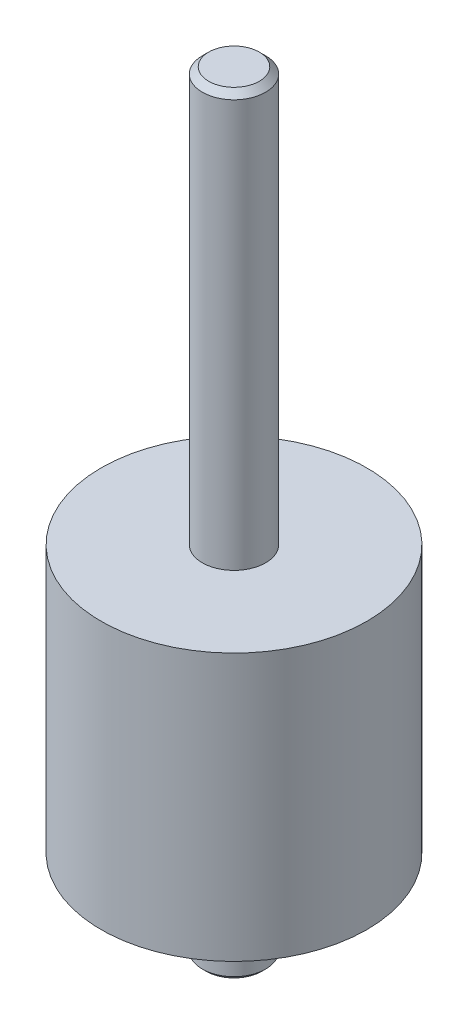
ISO-10303-21;
HEADER;
FILE_DESCRIPTION(('STEP AP214'),'2;1');
FILE_NAME('part.step','',(''),(''),'','','');
FILE_SCHEMA(('AUTOMOTIVE_DESIGN { 1 0 10303 214 1 1 1 1 }'));
ENDSEC;
DATA;
#1=APPLICATION_CONTEXT('core data for automotive mechanical design processes');
#2=APPLICATION_PROTOCOL_DEFINITION('international standard','automotive_design',2000,#1);
#3=PRODUCT_CONTEXT('',#1,'mechanical');
#4=PRODUCT('Part','Part','',(#3));
#5=PRODUCT_RELATED_PRODUCT_CATEGORY('part','',(#4));
#6=PRODUCT_DEFINITION_FORMATION('','',#4);
#7=PRODUCT_DEFINITION_CONTEXT('part definition',#1,'design');
#8=PRODUCT_DEFINITION('design','',#6,#7);
#9=PRODUCT_DEFINITION_SHAPE('','',#8);
#10=(LENGTH_UNIT() NAMED_UNIT(*) SI_UNIT(.MILLI.,.METRE.));
#11=(NAMED_UNIT(*) PLANE_ANGLE_UNIT() SI_UNIT($,.RADIAN.));
#12=(NAMED_UNIT(*) SI_UNIT($,.STERADIAN.) SOLID_ANGLE_UNIT());
#13=UNCERTAINTY_MEASURE_WITH_UNIT(LENGTH_MEASURE(1.E-05),#10,'distance_accuracy_value','');
#14=(GEOMETRIC_REPRESENTATION_CONTEXT(3) GLOBAL_UNCERTAINTY_ASSIGNED_CONTEXT((#13)) GLOBAL_UNIT_ASSIGNED_CONTEXT((#10,
#11,#12)) REPRESENTATION_CONTEXT('',''));
#15=CARTESIAN_POINT('',(0.,0.,0.));
#16=DIRECTION('',(0.,0.,1.));
#17=DIRECTION('',(1.,0.,0.));
#18=AXIS2_PLACEMENT_3D('',#15,#16,#17);
#19=CARTESIAN_POINT('',(0.,-38.6,0.));
#20=DIRECTION('',(0.,1.,0.));
#21=DIRECTION('',(-1.,0.,0.));
#22=AXIS2_PLACEMENT_3D('',#19,#20,#21);
#23=PLANE('',#22);
#24=CARTESIAN_POINT('',(0.,-38.6,0.));
#25=DIRECTION('',(0.,1.,0.));
#26=DIRECTION('',(-1.,0.,0.));
#27=AXIS2_PLACEMENT_3D('',#24,#25,#26);
#28=CIRCLE('',#27,2.2);
#29=CARTESIAN_POINT('',(-2.19999999999999,-38.6,0.));
#30=VERTEX_POINT('',#29);
#31=EDGE_CURVE('E44',#30,#30,#28,.F.);
#32=ORIENTED_EDGE('',*,*,#31,.T.);
#33=EDGE_LOOP('',(#32));
#34=FACE_BOUND('',#33,.T.);
#35=ADVANCED_FACE('F33',(#34),#23,.F.);
#36=CARTESIAN_POINT('',(0.,22.2,0.));
#37=DIRECTION('',(0.,1.,0.));
#38=DIRECTION('',(-1.,0.,0.));
#39=AXIS2_PLACEMENT_3D('',#36,#37,#38);
#40=CYLINDRICAL_SURFACE('',#39,2.5);
#41=CARTESIAN_POINT('',(0.,-38.3,0.));
#42=DIRECTION('',(0.,1.,0.));
#43=DIRECTION('',(-1.,0.,0.));
#44=AXIS2_PLACEMENT_3D('',#41,#42,#43);
#45=CIRCLE('',#44,2.5);
#46=CARTESIAN_POINT('',(-2.49999999999999,-38.3,0.));
#47=VERTEX_POINT('',#46);
#48=EDGE_CURVE('E48',#47,#47,#45,.T.);
#49=ORIENTED_EDGE('',*,*,#48,.T.);
#50=EDGE_LOOP('',(#49));
#51=FACE_BOUND('',#50,.T.);
#52=CARTESIAN_POINT('',(0.,-31.6,0.));
#53=DIRECTION('',(0.,1.,0.));
#54=DIRECTION('',(-1.,0.,0.));
#55=AXIS2_PLACEMENT_3D('',#52,#53,#54);
#56=CIRCLE('',#55,2.5);
#57=CARTESIAN_POINT('',(-2.49999999999999,-31.6,0.));
#58=VERTEX_POINT('',#57);
#59=EDGE_CURVE('E53',#58,#58,#56,.T.);
#60=ORIENTED_EDGE('',*,*,#59,.F.);
#61=EDGE_LOOP('',(#60));
#62=FACE_BOUND('',#61,.T.);
#63=ADVANCED_FACE('F83',(#51,#62),#40,.T.);
#64=CARTESIAN_POINT('',(2.50000000000001,-31.6,0.));
#65=DIRECTION('',(0.,1.,0.));
#66=DIRECTION('',(-1.,0.,0.));
#67=AXIS2_PLACEMENT_3D('',#64,#65,#66);
#68=PLANE('',#67);
#69=CARTESIAN_POINT('',(0.,-31.6,0.));
#70=DIRECTION('',(0.,1.,0.));
#71=DIRECTION('',(-1.,0.,0.));
#72=AXIS2_PLACEMENT_3D('',#69,#70,#71);
#73=CIRCLE('',#72,10.5);
#74=CARTESIAN_POINT('',(-10.5,-31.6,0.));
#75=VERTEX_POINT('',#74);
#76=EDGE_CURVE('E56',#75,#75,#73,.T.);
#77=ORIENTED_EDGE('',*,*,#76,.F.);
#78=EDGE_LOOP('',(#77));
#79=FACE_BOUND('',#78,.T.);
#80=ORIENTED_EDGE('',*,*,#59,.T.);
#81=EDGE_LOOP('',(#80));
#82=FACE_BOUND('',#81,.T.);
#83=ADVANCED_FACE('F77',(#79,#82),#68,.F.);
#84=CARTESIAN_POINT('',(0.,22.2,0.));
#85=DIRECTION('',(0.,1.,0.));
#86=DIRECTION('',(-1.,0.,0.));
#87=AXIS2_PLACEMENT_3D('',#84,#85,#86);
#88=CYLINDRICAL_SURFACE('',#87,10.5);
#89=CARTESIAN_POINT('',(0.,-10.5,0.));
#90=DIRECTION('',(0.,1.,0.));
#91=DIRECTION('',(-1.,0.,0.));
#92=AXIS2_PLACEMENT_3D('',#89,#90,#91);
#93=CIRCLE('',#92,10.5);
#94=CARTESIAN_POINT('',(-10.5,-10.5,0.));
#95=VERTEX_POINT('',#94);
#96=EDGE_CURVE('E59',#95,#95,#93,.T.);
#97=ORIENTED_EDGE('',*,*,#96,.F.);
#98=EDGE_LOOP('',(#97));
#99=FACE_BOUND('',#98,.T.);
#100=ORIENTED_EDGE('',*,*,#76,.T.);
#101=EDGE_LOOP('',(#100));
#102=FACE_BOUND('',#101,.T.);
#103=ADVANCED_FACE('F71',(#99,#102),#88,.T.);
#104=CARTESIAN_POINT('',(10.5,-10.5,0.));
#105=DIRECTION('',(0.,-1.,0.));
#106=DIRECTION('',(1.,0.,0.));
#107=AXIS2_PLACEMENT_3D('',#104,#105,#106);
#108=PLANE('',#107);
#109=CARTESIAN_POINT('',(0.,-10.5,0.));
#110=DIRECTION('',(0.,1.,0.));
#111=DIRECTION('',(-1.,0.,0.));
#112=AXIS2_PLACEMENT_3D('',#109,#110,#111);
#113=CIRCLE('',#112,2.5);
#114=CARTESIAN_POINT('',(-2.5,-10.5,0.));
#115=VERTEX_POINT('',#114);
#116=EDGE_CURVE('E62',#115,#115,#113,.T.);
#117=ORIENTED_EDGE('',*,*,#116,.F.);
#118=EDGE_LOOP('',(#117));
#119=FACE_BOUND('',#118,.T.);
#120=ORIENTED_EDGE('',*,*,#96,.T.);
#121=EDGE_LOOP('',(#120));
#122=FACE_BOUND('',#121,.T.);
#123=ADVANCED_FACE('F68',(#119,#122),#108,.F.);
#124=CARTESIAN_POINT('',(0.,22.2,0.));
#125=DIRECTION('',(0.,1.,0.));
#126=DIRECTION('',(-1.,0.,0.));
#127=AXIS2_PLACEMENT_3D('',#124,#125,#126);
#128=CYLINDRICAL_SURFACE('',#127,2.50000000000001);
#129=CARTESIAN_POINT('',(0.,21.7,0.));
#130=DIRECTION('',(0.,-1.,0.));
#131=DIRECTION('',(1.,0.,0.));
#132=AXIS2_PLACEMENT_3D('',#129,#130,#131);
#133=CIRCLE('',#132,2.50000000000001);
#134=CARTESIAN_POINT('',(2.50000000000001,21.7,0.));
#135=VERTEX_POINT('',#134);
#136=EDGE_CURVE('E10',#135,#135,#133,.T.);
#137=ORIENTED_EDGE('',*,*,#136,.T.);
#138=EDGE_LOOP('',(#137));
#139=FACE_BOUND('',#138,.T.);
#140=ORIENTED_EDGE('',*,*,#116,.T.);
#141=EDGE_LOOP('',(#140));
#142=FACE_BOUND('',#141,.T.);
#143=ADVANCED_FACE('F66',(#139,#142),#128,.T.);
#144=CARTESIAN_POINT('',(2.50000000000001,22.2,0.));
#145=DIRECTION('',(0.,-1.,0.));
#146=DIRECTION('',(1.,0.,0.));
#147=AXIS2_PLACEMENT_3D('',#144,#145,#146);
#148=PLANE('',#147);
#149=CARTESIAN_POINT('',(0.,22.2,0.));
#150=DIRECTION('',(0.,-1.,0.));
#151=DIRECTION('',(1.,0.,0.));
#152=AXIS2_PLACEMENT_3D('',#149,#150,#151);
#153=CIRCLE('',#152,2.00000000000003);
#154=CARTESIAN_POINT('',(2.00000000000003,22.2,0.));
#155=VERTEX_POINT('',#154);
#156=EDGE_CURVE('E40',#155,#155,#153,.F.);
#157=ORIENTED_EDGE('',*,*,#156,.T.);
#158=EDGE_LOOP('',(#157));
#159=FACE_BOUND('',#158,.T.);
#160=ADVANCED_FACE('F97',(#159),#148,.F.);
#161=CARTESIAN_POINT('',(0.,-38.3,0.));
#162=DIRECTION('',(0.,1.,0.));
#163=DIRECTION('',(-1.,0.,0.));
#164=AXIS2_PLACEMENT_3D('',#161,#162,#163);
#165=CONICAL_SURFACE('',#164,2.5,0.785398163397446);
#166=ORIENTED_EDGE('',*,*,#31,.F.);
#167=EDGE_LOOP('',(#166));
#168=FACE_BOUND('',#167,.T.);
#169=ORIENTED_EDGE('',*,*,#48,.F.);
#170=EDGE_LOOP('',(#169));
#171=FACE_BOUND('',#170,.T.);
#172=ADVANCED_FACE('F95',(#168,#171),#165,.T.);
#173=CARTESIAN_POINT('',(0.,22.2,0.));
#174=DIRECTION('',(0.,-1.,0.));
#175=DIRECTION('',(1.,0.,0.));
#176=AXIS2_PLACEMENT_3D('',#173,#174,#175);
#177=CONICAL_SURFACE('',#176,2.00000000000003,0.785398163397438);
#178=ORIENTED_EDGE('',*,*,#136,.F.);
#179=EDGE_LOOP('',(#178));
#180=FACE_BOUND('',#179,.T.);
#181=ORIENTED_EDGE('',*,*,#156,.F.);
#182=EDGE_LOOP('',(#181));
#183=FACE_BOUND('',#182,.T.);
#184=ADVANCED_FACE('F35',(#180,#183),#177,.T.);
#185=CLOSED_SHELL('',(#35,#63,#83,#103,#123,#143,#160,#172,#184));
#186=MANIFOLD_SOLID_BREP('B2',#185);
#187=ADVANCED_BREP_SHAPE_REPRESENTATION('',(#18,#186),#14);
#188=SHAPE_DEFINITION_REPRESENTATION(#9,#187);
ENDSEC;
END-ISO-10303-21;
